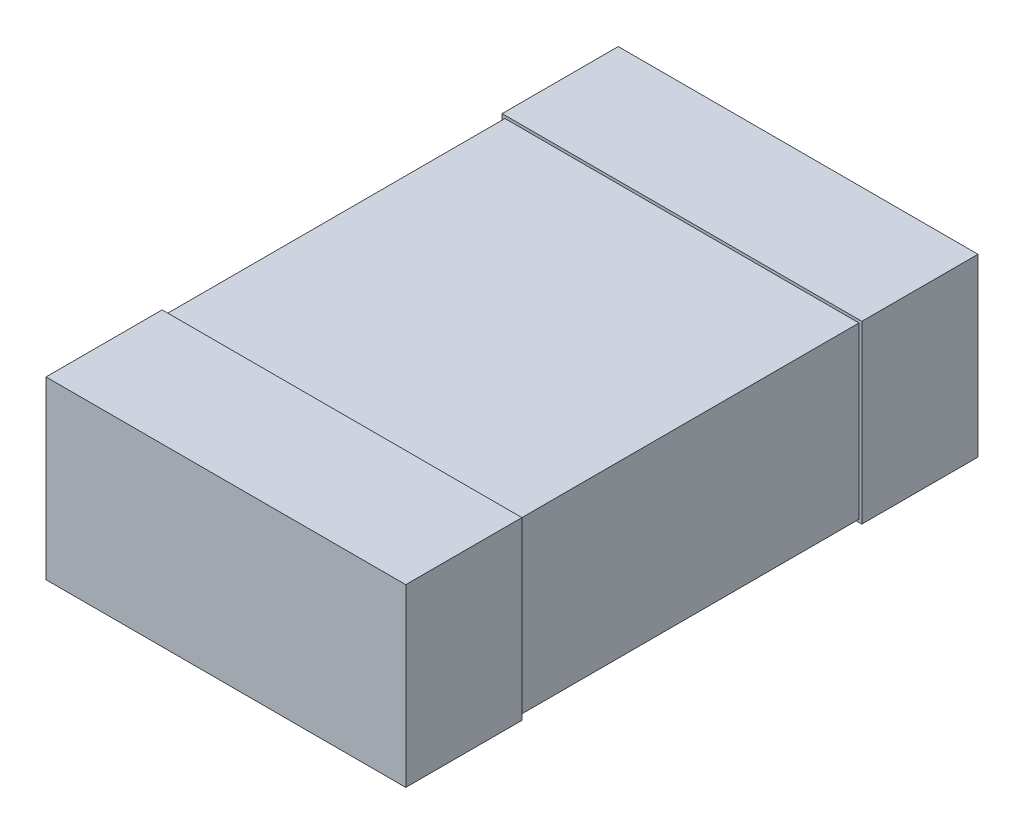
ISO-10303-21;
HEADER;
FILE_DESCRIPTION(('STEP AP214'),'2;1');
FILE_NAME('part.step','',(''),(''),'','','');
FILE_SCHEMA(('AUTOMOTIVE_DESIGN { 1 0 10303 214 1 1 1 1 }'));
ENDSEC;
DATA;
#1=APPLICATION_CONTEXT('core data for automotive mechanical design processes');
#2=APPLICATION_PROTOCOL_DEFINITION('international standard','automotive_design',2000,#1);
#3=PRODUCT_CONTEXT('',#1,'mechanical');
#4=PRODUCT('Part','Part','',(#3));
#5=PRODUCT_RELATED_PRODUCT_CATEGORY('part','',(#4));
#6=PRODUCT_DEFINITION_FORMATION('','',#4);
#7=PRODUCT_DEFINITION_CONTEXT('part definition',#1,'design');
#8=PRODUCT_DEFINITION('design','',#6,#7);
#9=PRODUCT_DEFINITION_SHAPE('','',#8);
#10=(LENGTH_UNIT() NAMED_UNIT(*) SI_UNIT(.MILLI.,.METRE.));
#11=(NAMED_UNIT(*) PLANE_ANGLE_UNIT() SI_UNIT($,.RADIAN.));
#12=(NAMED_UNIT(*) SI_UNIT($,.STERADIAN.) SOLID_ANGLE_UNIT());
#13=UNCERTAINTY_MEASURE_WITH_UNIT(LENGTH_MEASURE(1.E-05),#10,'distance_accuracy_value','');
#14=(GEOMETRIC_REPRESENTATION_CONTEXT(3) GLOBAL_UNCERTAINTY_ASSIGNED_CONTEXT((#13)) GLOBAL_UNIT_ASSIGNED_CONTEXT((#10,
#11,#12)) REPRESENTATION_CONTEXT('',''));
#15=CARTESIAN_POINT('',(0.,0.,0.));
#16=DIRECTION('',(0.,0.,1.));
#17=DIRECTION('',(1.,0.,0.));
#18=AXIS2_PLACEMENT_3D('',#15,#16,#17);
#19=CARTESIAN_POINT('',(-0.635,-0.01,-1.01));
#20=DIRECTION('',(0.,0.,-1.));
#21=DIRECTION('',(0.,-1.,0.));
#22=AXIS2_PLACEMENT_3D('',#19,#20,#21);
#23=PLANE('',#22);
#24=DIRECTION('',(0.,-1.,0.));
#25=VECTOR('',#24,1.);
#26=CARTESIAN_POINT('',(0.635,-0.01,-1.01));
#27=LINE('',#26,#25);
#28=CARTESIAN_POINT('',(0.635,0.61,-1.01));
#29=VERTEX_POINT('',#28);
#30=CARTESIAN_POINT('',(0.635,-0.01,-1.01));
#31=VERTEX_POINT('',#30);
#32=EDGE_CURVE('E188',#29,#31,#27,.T.);
#33=ORIENTED_EDGE('',*,*,#32,.T.);
#34=DIRECTION('',(-1.,0.,0.));
#35=VECTOR('',#34,1.);
#36=CARTESIAN_POINT('',(-0.635,-0.01,-1.01));
#37=LINE('',#36,#35);
#38=CARTESIAN_POINT('',(-0.635,-0.01,-1.01));
#39=VERTEX_POINT('',#38);
#40=EDGE_CURVE('E248',#31,#39,#37,.T.);
#41=ORIENTED_EDGE('',*,*,#40,.T.);
#42=DIRECTION('',(0.,1.,0.));
#43=VECTOR('',#42,1.);
#44=CARTESIAN_POINT('',(-0.635,0.61,-1.01));
#45=LINE('',#44,#43);
#46=CARTESIAN_POINT('',(-0.635,0.61,-1.01));
#47=VERTEX_POINT('',#46);
#48=EDGE_CURVE('E173',#39,#47,#45,.T.);
#49=ORIENTED_EDGE('',*,*,#48,.T.);
#50=DIRECTION('',(1.,0.,0.));
#51=VECTOR('',#50,1.);
#52=CARTESIAN_POINT('',(0.635,0.61,-1.01));
#53=LINE('',#52,#51);
#54=EDGE_CURVE('E11',#47,#29,#53,.T.);
#55=ORIENTED_EDGE('',*,*,#54,.T.);
#56=EDGE_LOOP('',(#33,#41,#49,#55));
#57=FACE_BOUND('',#56,.T.);
#58=ADVANCED_FACE('F18',(#57),#23,.T.);
#59=CARTESIAN_POINT('',(-0.635,-0.01,1.01));
#60=DIRECTION('',(0.,0.,1.));
#61=DIRECTION('',(1.,0.,0.));
#62=AXIS2_PLACEMENT_3D('',#59,#60,#61);
#63=PLANE('',#62);
#64=DIRECTION('',(0.,-1.,0.));
#65=VECTOR('',#64,1.);
#66=CARTESIAN_POINT('',(0.635,-0.01,1.01));
#67=LINE('',#66,#65);
#68=CARTESIAN_POINT('',(0.635,0.61,1.01));
#69=VERTEX_POINT('',#68);
#70=CARTESIAN_POINT('',(0.635,-0.01,1.01));
#71=VERTEX_POINT('',#70);
#72=EDGE_CURVE('E195',#69,#71,#67,.T.);
#73=ORIENTED_EDGE('',*,*,#72,.F.);
#74=DIRECTION('',(1.,0.,0.));
#75=VECTOR('',#74,1.);
#76=CARTESIAN_POINT('',(0.635,0.61,1.01));
#77=LINE('',#76,#75);
#78=CARTESIAN_POINT('',(-0.635,0.61,1.01));
#79=VERTEX_POINT('',#78);
#80=EDGE_CURVE('E196',#79,#69,#77,.T.);
#81=ORIENTED_EDGE('',*,*,#80,.F.);
#82=DIRECTION('',(0.,1.,0.));
#83=VECTOR('',#82,1.);
#84=CARTESIAN_POINT('',(-0.635,0.61,1.01));
#85=LINE('',#84,#83);
#86=CARTESIAN_POINT('',(-0.635,-0.01,1.01));
#87=VERTEX_POINT('',#86);
#88=EDGE_CURVE('E171',#87,#79,#85,.T.);
#89=ORIENTED_EDGE('',*,*,#88,.F.);
#90=DIRECTION('',(-1.,0.,0.));
#91=VECTOR('',#90,1.);
#92=CARTESIAN_POINT('',(-0.635,-0.01,1.01));
#93=LINE('',#92,#91);
#94=EDGE_CURVE('E21',#71,#87,#93,.T.);
#95=ORIENTED_EDGE('',*,*,#94,.F.);
#96=EDGE_LOOP('',(#73,#81,#89,#95));
#97=FACE_BOUND('',#96,.T.);
#98=ADVANCED_FACE('F225',(#97),#63,.T.);
#99=CARTESIAN_POINT('',(0.635,0.61,-0.6));
#100=DIRECTION('',(0.,-1.,0.));
#101=DIRECTION('',(0.,0.,-1.));
#102=AXIS2_PLACEMENT_3D('',#99,#100,#101);
#103=PLANE('',#102);
#104=ORIENTED_EDGE('',*,*,#54,.F.);
#105=DIRECTION('',(0.,0.,1.));
#106=VECTOR('',#105,1.);
#107=CARTESIAN_POINT('',(-0.635,0.61,-0.6));
#108=LINE('',#107,#106);
#109=CARTESIAN_POINT('',(-0.635,0.61,-0.6));
#110=VERTEX_POINT('',#109);
#111=EDGE_CURVE('E275',#47,#110,#108,.T.);
#112=ORIENTED_EDGE('',*,*,#111,.T.);
#113=DIRECTION('',(1.,0.,0.));
#114=VECTOR('',#113,1.);
#115=CARTESIAN_POINT('',(-0.635,0.61,-0.6));
#116=LINE('',#115,#114);
#117=CARTESIAN_POINT('',(0.635,0.61,-0.6));
#118=VERTEX_POINT('',#117);
#119=EDGE_CURVE('E202',#110,#118,#116,.T.);
#120=ORIENTED_EDGE('',*,*,#119,.T.);
#121=DIRECTION('',(0.,0.,-1.));
#122=VECTOR('',#121,1.);
#123=CARTESIAN_POINT('',(0.635,0.61,-0.6));
#124=LINE('',#123,#122);
#125=EDGE_CURVE('E28',#118,#29,#124,.T.);
#126=ORIENTED_EDGE('',*,*,#125,.T.);
#127=EDGE_LOOP('',(#104,#112,#120,#126));
#128=FACE_BOUND('',#127,.T.);
#129=ADVANCED_FACE('F302',(#128),#103,.F.);
#130=CARTESIAN_POINT('',(0.635,-0.01,-0.6));
#131=DIRECTION('',(-1.,0.,0.));
#132=DIRECTION('',(0.,0.,1.));
#133=AXIS2_PLACEMENT_3D('',#130,#131,#132);
#134=PLANE('',#133);
#135=ORIENTED_EDGE('',*,*,#32,.F.);
#136=ORIENTED_EDGE('',*,*,#125,.F.);
#137=DIRECTION('',(0.,-1.,0.));
#138=VECTOR('',#137,1.);
#139=CARTESIAN_POINT('',(0.635,-0.01,-0.6));
#140=LINE('',#139,#138);
#141=CARTESIAN_POINT('',(0.635,-0.01,-0.6));
#142=VERTEX_POINT('',#141);
#143=EDGE_CURVE('E207',#118,#142,#140,.T.);
#144=ORIENTED_EDGE('',*,*,#143,.T.);
#145=DIRECTION('',(0.,0.,-1.));
#146=VECTOR('',#145,1.);
#147=CARTESIAN_POINT('',(0.635,-0.01,-0.6));
#148=LINE('',#147,#146);
#149=EDGE_CURVE('E115',#142,#31,#148,.T.);
#150=ORIENTED_EDGE('',*,*,#149,.T.);
#151=EDGE_LOOP('',(#135,#136,#144,#150));
#152=FACE_BOUND('',#151,.T.);
#153=ADVANCED_FACE('F307',(#152),#134,.F.);
#154=CARTESIAN_POINT('',(-0.635,-0.01,-0.6));
#155=DIRECTION('',(0.,1.,0.));
#156=DIRECTION('',(1.,0.,0.));
#157=AXIS2_PLACEMENT_3D('',#154,#155,#156);
#158=PLANE('',#157);
#159=ORIENTED_EDGE('',*,*,#40,.F.);
#160=ORIENTED_EDGE('',*,*,#149,.F.);
#161=DIRECTION('',(-1.,0.,0.));
#162=VECTOR('',#161,1.);
#163=CARTESIAN_POINT('',(-0.635,-0.01,-0.6));
#164=LINE('',#163,#162);
#165=CARTESIAN_POINT('',(-0.635,-0.01,-0.6));
#166=VERTEX_POINT('',#165);
#167=EDGE_CURVE('E148',#142,#166,#164,.T.);
#168=ORIENTED_EDGE('',*,*,#167,.T.);
#169=DIRECTION('',(0.,0.,-1.));
#170=VECTOR('',#169,1.);
#171=CARTESIAN_POINT('',(-0.635,-0.01,-0.6));
#172=LINE('',#171,#170);
#173=EDGE_CURVE('E176',#166,#39,#172,.T.);
#174=ORIENTED_EDGE('',*,*,#173,.T.);
#175=EDGE_LOOP('',(#159,#160,#168,#174));
#176=FACE_BOUND('',#175,.T.);
#177=ADVANCED_FACE('F292',(#176),#158,.F.);
#178=CARTESIAN_POINT('',(-0.635,0.61,-0.6));
#179=DIRECTION('',(1.,0.,0.));
#180=DIRECTION('',(0.,1.,0.));
#181=AXIS2_PLACEMENT_3D('',#178,#179,#180);
#182=PLANE('',#181);
#183=ORIENTED_EDGE('',*,*,#48,.F.);
#184=ORIENTED_EDGE('',*,*,#173,.F.);
#185=DIRECTION('',(0.,1.,0.));
#186=VECTOR('',#185,1.);
#187=CARTESIAN_POINT('',(-0.635,-0.01,-0.6));
#188=LINE('',#187,#186);
#189=EDGE_CURVE('E206',#166,#110,#188,.T.);
#190=ORIENTED_EDGE('',*,*,#189,.T.);
#191=ORIENTED_EDGE('',*,*,#111,.F.);
#192=EDGE_LOOP('',(#183,#184,#190,#191));
#193=FACE_BOUND('',#192,.T.);
#194=ADVANCED_FACE('F298',(#193),#182,.F.);
#195=CARTESIAN_POINT('',(-0.625,0.,1.));
#196=DIRECTION('',(0.,1.,0.));
#197=DIRECTION('',(1.,0.,0.));
#198=AXIS2_PLACEMENT_3D('',#195,#196,#197);
#199=PLANE('',#198);
#200=DIRECTION('',(0.,0.,1.));
#201=VECTOR('',#200,1.);
#202=CARTESIAN_POINT('',(0.625,0.,-1.));
#203=LINE('',#202,#201);
#204=CARTESIAN_POINT('',(0.625,0.,-0.6));
#205=VERTEX_POINT('',#204);
#206=CARTESIAN_POINT('',(0.625,0.,0.6));
#207=VERTEX_POINT('',#206);
#208=EDGE_CURVE('E139',#205,#207,#203,.T.);
#209=ORIENTED_EDGE('',*,*,#208,.T.);
#210=DIRECTION('',(-1.,0.,0.));
#211=VECTOR('',#210,1.);
#212=CARTESIAN_POINT('',(-0.635,0.,0.6));
#213=LINE('',#212,#211);
#214=CARTESIAN_POINT('',(-0.625,0.,0.6));
#215=VERTEX_POINT('',#214);
#216=EDGE_CURVE('E152',#207,#215,#213,.T.);
#217=ORIENTED_EDGE('',*,*,#216,.T.);
#218=DIRECTION('',(0.,0.,-1.));
#219=VECTOR('',#218,1.);
#220=CARTESIAN_POINT('',(-0.625,0.,-1.));
#221=LINE('',#220,#219);
#222=CARTESIAN_POINT('',(-0.625,0.,-0.6));
#223=VERTEX_POINT('',#222);
#224=EDGE_CURVE('E143',#215,#223,#221,.T.);
#225=ORIENTED_EDGE('',*,*,#224,.T.);
#226=DIRECTION('',(1.,0.,0.));
#227=VECTOR('',#226,1.);
#228=CARTESIAN_POINT('',(-0.635,0.,-0.6));
#229=LINE('',#228,#227);
#230=EDGE_CURVE('E128',#223,#205,#229,.T.);
#231=ORIENTED_EDGE('',*,*,#230,.T.);
#232=EDGE_LOOP('',(#209,#217,#225,#231));
#233=FACE_BOUND('',#232,.T.);
#234=ADVANCED_FACE('F150',(#233),#199,.F.);
#235=CARTESIAN_POINT('',(-0.635,-0.01,0.6));
#236=DIRECTION('',(0.,-1.,0.));
#237=DIRECTION('',(0.,0.,-1.));
#238=AXIS2_PLACEMENT_3D('',#235,#236,#237);
#239=PLANE('',#238);
#240=DIRECTION('',(0.,0.,1.));
#241=VECTOR('',#240,1.);
#242=CARTESIAN_POINT('',(-0.635,-0.01,0.6));
#243=LINE('',#242,#241);
#244=CARTESIAN_POINT('',(-0.635,-0.01,0.6));
#245=VERTEX_POINT('',#244);
#246=EDGE_CURVE('E167',#245,#87,#243,.T.);
#247=ORIENTED_EDGE('',*,*,#246,.F.);
#248=DIRECTION('',(1.,0.,0.));
#249=VECTOR('',#248,1.);
#250=CARTESIAN_POINT('',(-0.635,-0.01,0.6));
#251=LINE('',#250,#249);
#252=CARTESIAN_POINT('',(0.635,-0.01,0.6));
#253=VERTEX_POINT('',#252);
#254=EDGE_CURVE('E180',#245,#253,#251,.T.);
#255=ORIENTED_EDGE('',*,*,#254,.T.);
#256=DIRECTION('',(0.,0.,-1.));
#257=VECTOR('',#256,1.);
#258=CARTESIAN_POINT('',(0.635,-0.01,0.6));
#259=LINE('',#258,#257);
#260=EDGE_CURVE('E192',#71,#253,#259,.T.);
#261=ORIENTED_EDGE('',*,*,#260,.F.);
#262=ORIENTED_EDGE('',*,*,#94,.T.);
#263=EDGE_LOOP('',(#247,#255,#261,#262));
#264=FACE_BOUND('',#263,.T.);
#265=ADVANCED_FACE('F221',(#264),#239,.T.);
#266=CARTESIAN_POINT('',(0.635,-0.01,0.6));
#267=DIRECTION('',(1.,0.,0.));
#268=DIRECTION('',(0.,1.,0.));
#269=AXIS2_PLACEMENT_3D('',#266,#267,#268);
#270=PLANE('',#269);
#271=ORIENTED_EDGE('',*,*,#260,.T.);
#272=DIRECTION('',(0.,1.,0.));
#273=VECTOR('',#272,1.);
#274=CARTESIAN_POINT('',(0.635,-0.01,0.6));
#275=LINE('',#274,#273);
#276=CARTESIAN_POINT('',(0.635,0.61,0.6));
#277=VERTEX_POINT('',#276);
#278=EDGE_CURVE('E185',#253,#277,#275,.T.);
#279=ORIENTED_EDGE('',*,*,#278,.T.);
#280=DIRECTION('',(0.,0.,-1.));
#281=VECTOR('',#280,1.);
#282=CARTESIAN_POINT('',(0.635,0.61,0.6));
#283=LINE('',#282,#281);
#284=EDGE_CURVE('E230',#69,#277,#283,.T.);
#285=ORIENTED_EDGE('',*,*,#284,.F.);
#286=ORIENTED_EDGE('',*,*,#72,.T.);
#287=EDGE_LOOP('',(#271,#279,#285,#286));
#288=FACE_BOUND('',#287,.T.);
#289=ADVANCED_FACE('F427',(#288),#270,.T.);
#290=CARTESIAN_POINT('',(0.635,0.61,0.6));
#291=DIRECTION('',(0.,1.,0.));
#292=DIRECTION('',(1.,0.,0.));
#293=AXIS2_PLACEMENT_3D('',#290,#291,#292);
#294=PLANE('',#293);
#295=ORIENTED_EDGE('',*,*,#284,.T.);
#296=DIRECTION('',(-1.,0.,0.));
#297=VECTOR('',#296,1.);
#298=CARTESIAN_POINT('',(-0.635,0.61,0.6));
#299=LINE('',#298,#297);
#300=CARTESIAN_POINT('',(-0.635,0.61,0.6));
#301=VERTEX_POINT('',#300);
#302=EDGE_CURVE('E197',#277,#301,#299,.T.);
#303=ORIENTED_EDGE('',*,*,#302,.T.);
#304=DIRECTION('',(0.,0.,-1.));
#305=VECTOR('',#304,1.);
#306=CARTESIAN_POINT('',(-0.635,0.61,0.6));
#307=LINE('',#306,#305);
#308=EDGE_CURVE('E172',#79,#301,#307,.T.);
#309=ORIENTED_EDGE('',*,*,#308,.F.);
#310=ORIENTED_EDGE('',*,*,#80,.T.);
#311=EDGE_LOOP('',(#295,#303,#309,#310));
#312=FACE_BOUND('',#311,.T.);
#313=ADVANCED_FACE('F507',(#312),#294,.T.);
#314=CARTESIAN_POINT('',(-0.635,0.61,0.6));
#315=DIRECTION('',(-1.,0.,0.));
#316=DIRECTION('',(0.,0.,1.));
#317=AXIS2_PLACEMENT_3D('',#314,#315,#316);
#318=PLANE('',#317);
#319=ORIENTED_EDGE('',*,*,#308,.T.);
#320=DIRECTION('',(0.,-1.,0.));
#321=VECTOR('',#320,1.);
#322=CARTESIAN_POINT('',(-0.635,-0.01,0.6));
#323=LINE('',#322,#321);
#324=EDGE_CURVE('E184',#301,#245,#323,.T.);
#325=ORIENTED_EDGE('',*,*,#324,.T.);
#326=ORIENTED_EDGE('',*,*,#246,.T.);
#327=ORIENTED_EDGE('',*,*,#88,.T.);
#328=EDGE_LOOP('',(#319,#325,#326,#327));
#329=FACE_BOUND('',#328,.T.);
#330=ADVANCED_FACE('F231',(#329),#318,.T.);
#331=CARTESIAN_POINT('',(0.625,0.6,-1.));
#332=DIRECTION('',(-1.,0.,0.));
#333=DIRECTION('',(0.,0.,1.));
#334=AXIS2_PLACEMENT_3D('',#331,#332,#333);
#335=PLANE('',#334);
#336=DIRECTION('',(0.,0.,-1.));
#337=VECTOR('',#336,1.);
#338=CARTESIAN_POINT('',(0.625,0.6,1.));
#339=LINE('',#338,#337);
#340=CARTESIAN_POINT('',(0.625,0.6,0.6));
#341=VERTEX_POINT('',#340);
#342=CARTESIAN_POINT('',(0.625,0.6,-0.6));
#343=VERTEX_POINT('',#342);
#344=EDGE_CURVE('E257',#341,#343,#339,.T.);
#345=ORIENTED_EDGE('',*,*,#344,.F.);
#346=DIRECTION('',(0.,-1.,0.));
#347=VECTOR('',#346,1.);
#348=CARTESIAN_POINT('',(0.625,-0.01,0.6));
#349=LINE('',#348,#347);
#350=EDGE_CURVE('E155',#341,#207,#349,.T.);
#351=ORIENTED_EDGE('',*,*,#350,.T.);
#352=ORIENTED_EDGE('',*,*,#208,.F.);
#353=DIRECTION('',(0.,1.,0.));
#354=VECTOR('',#353,1.);
#355=CARTESIAN_POINT('',(0.625,-0.01,-0.6));
#356=LINE('',#355,#354);
#357=EDGE_CURVE('E135',#205,#343,#356,.T.);
#358=ORIENTED_EDGE('',*,*,#357,.T.);
#359=EDGE_LOOP('',(#345,#351,#352,#358));
#360=FACE_BOUND('',#359,.T.);
#361=ADVANCED_FACE('F479',(#360),#335,.F.);
#362=CARTESIAN_POINT('',(-0.635,-0.01,-0.6));
#363=DIRECTION('',(0.,0.,-1.));
#364=DIRECTION('',(0.,-1.,0.));
#365=AXIS2_PLACEMENT_3D('',#362,#363,#364);
#366=PLANE('',#365);
#367=ORIENTED_EDGE('',*,*,#357,.F.);
#368=ORIENTED_EDGE('',*,*,#230,.F.);
#369=DIRECTION('',(0.,1.,0.));
#370=VECTOR('',#369,1.);
#371=CARTESIAN_POINT('',(-0.625,0.6,-0.6));
#372=LINE('',#371,#370);
#373=CARTESIAN_POINT('',(-0.625,0.6,-0.6));
#374=VERTEX_POINT('',#373);
#375=EDGE_CURVE('E133',#223,#374,#372,.T.);
#376=ORIENTED_EDGE('',*,*,#375,.T.);
#377=DIRECTION('',(-1.,0.,0.));
#378=VECTOR('',#377,1.);
#379=CARTESIAN_POINT('',(-0.625,0.6,-0.6));
#380=LINE('',#379,#378);
#381=EDGE_CURVE('E200',#343,#374,#380,.T.);
#382=ORIENTED_EDGE('',*,*,#381,.F.);
#383=EDGE_LOOP('',(#367,#368,#376,#382));
#384=FACE_BOUND('',#383,.T.);
#385=ORIENTED_EDGE('',*,*,#167,.F.);
#386=ORIENTED_EDGE('',*,*,#143,.F.);
#387=ORIENTED_EDGE('',*,*,#119,.F.);
#388=ORIENTED_EDGE('',*,*,#189,.F.);
#389=EDGE_LOOP('',(#385,#386,#387,#388));
#390=FACE_BOUND('',#389,.T.);
#391=ADVANCED_FACE('F130',(#384,#390),#366,.F.);
#392=CARTESIAN_POINT('',(-0.625,0.6,-1.));
#393=DIRECTION('',(1.,0.,0.));
#394=DIRECTION('',(0.,1.,0.));
#395=AXIS2_PLACEMENT_3D('',#392,#393,#394);
#396=PLANE('',#395);
#397=ORIENTED_EDGE('',*,*,#224,.F.);
#398=DIRECTION('',(0.,1.,0.));
#399=VECTOR('',#398,1.);
#400=CARTESIAN_POINT('',(-0.625,-0.01,0.6));
#401=LINE('',#400,#399);
#402=CARTESIAN_POINT('',(-0.625,0.6,0.6));
#403=VERTEX_POINT('',#402);
#404=EDGE_CURVE('E165',#215,#403,#401,.T.);
#405=ORIENTED_EDGE('',*,*,#404,.T.);
#406=DIRECTION('',(0.,0.,1.));
#407=VECTOR('',#406,1.);
#408=CARTESIAN_POINT('',(-0.625,0.6,1.));
#409=LINE('',#408,#407);
#410=EDGE_CURVE('E146',#374,#403,#409,.T.);
#411=ORIENTED_EDGE('',*,*,#410,.F.);
#412=ORIENTED_EDGE('',*,*,#375,.F.);
#413=EDGE_LOOP('',(#397,#405,#411,#412));
#414=FACE_BOUND('',#413,.T.);
#415=ADVANCED_FACE('F142',(#414),#396,.F.);
#416=CARTESIAN_POINT('',(-0.635,-0.01,0.6));
#417=DIRECTION('',(0.,0.,1.));
#418=DIRECTION('',(1.,0.,0.));
#419=AXIS2_PLACEMENT_3D('',#416,#417,#418);
#420=PLANE('',#419);
#421=ORIENTED_EDGE('',*,*,#404,.F.);
#422=ORIENTED_EDGE('',*,*,#216,.F.);
#423=ORIENTED_EDGE('',*,*,#350,.F.);
#424=DIRECTION('',(1.,0.,0.));
#425=VECTOR('',#424,1.);
#426=CARTESIAN_POINT('',(-0.625,0.6,0.6));
#427=LINE('',#426,#425);
#428=EDGE_CURVE('E179',#403,#341,#427,.T.);
#429=ORIENTED_EDGE('',*,*,#428,.F.);
#430=EDGE_LOOP('',(#421,#422,#423,#429));
#431=FACE_BOUND('',#430,.T.);
#432=ORIENTED_EDGE('',*,*,#302,.F.);
#433=ORIENTED_EDGE('',*,*,#278,.F.);
#434=ORIENTED_EDGE('',*,*,#254,.F.);
#435=ORIENTED_EDGE('',*,*,#324,.F.);
#436=EDGE_LOOP('',(#432,#433,#434,#435));
#437=FACE_BOUND('',#436,.T.);
#438=ADVANCED_FACE('F237',(#431,#437),#420,.F.);
#439=CARTESIAN_POINT('',(-0.625,0.6,1.));
#440=DIRECTION('',(0.,1.,0.));
#441=DIRECTION('',(1.,0.,0.));
#442=AXIS2_PLACEMENT_3D('',#439,#440,#441);
#443=PLANE('',#442);
#444=ORIENTED_EDGE('',*,*,#410,.T.);
#445=ORIENTED_EDGE('',*,*,#428,.T.);
#446=ORIENTED_EDGE('',*,*,#344,.T.);
#447=ORIENTED_EDGE('',*,*,#381,.T.);
#448=EDGE_LOOP('',(#444,#445,#446,#447));
#449=FACE_BOUND('',#448,.T.);
#450=ADVANCED_FACE('F467',(#449),#443,.T.);
#451=CLOSED_SHELL('',(#58,#98,#129,#153,#177,#194,#234,#265,#289,#313,#330,#361,#391,#415,#438,#450));
#452=MANIFOLD_SOLID_BREP('B1',#451);
#453=ADVANCED_BREP_SHAPE_REPRESENTATION('',(#18,#452),#14);
#454=SHAPE_DEFINITION_REPRESENTATION(#9,#453);
ENDSEC;
END-ISO-10303-21;
